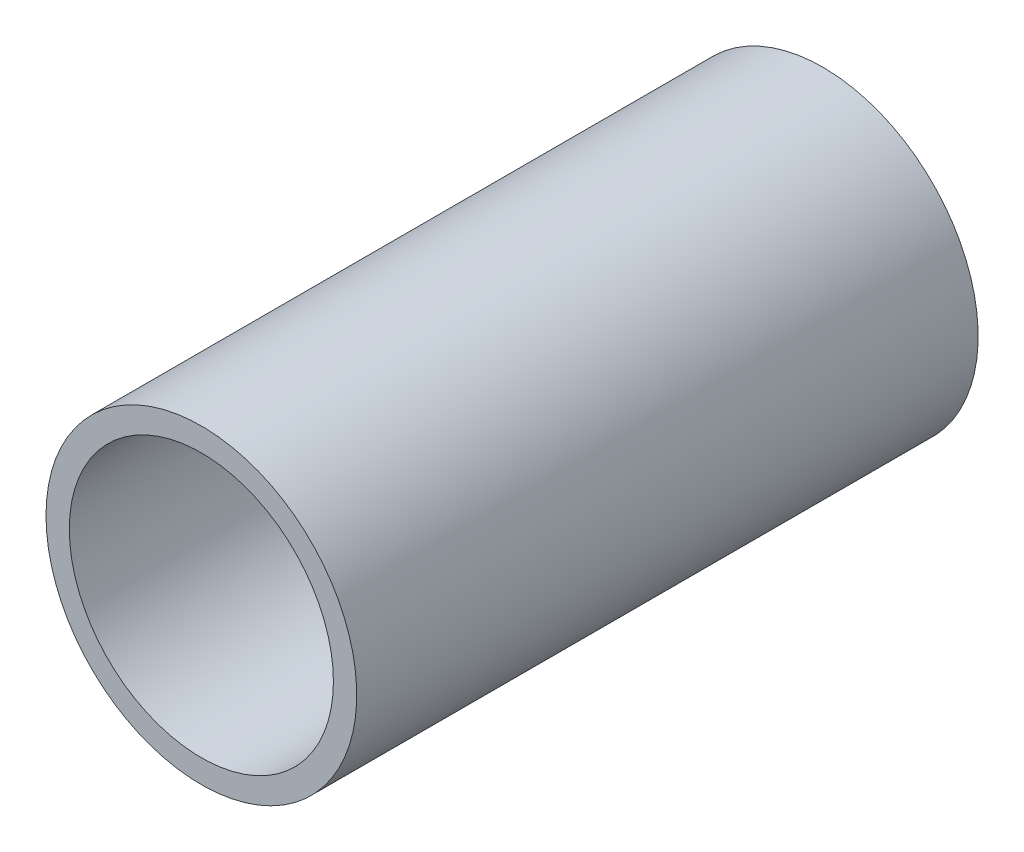
ISO-10303-21;
HEADER;
FILE_DESCRIPTION(('STEP AP214'),'2;1');
FILE_NAME('part.step','',(''),(''),'','','');
FILE_SCHEMA(('AUTOMOTIVE_DESIGN { 1 0 10303 214 1 1 1 1 }'));
ENDSEC;
DATA;
#1=APPLICATION_CONTEXT('core data for automotive mechanical design processes');
#2=APPLICATION_PROTOCOL_DEFINITION('international standard','automotive_design',2000,#1);
#3=PRODUCT_CONTEXT('',#1,'mechanical');
#4=PRODUCT('Part','Part','',(#3));
#5=PRODUCT_RELATED_PRODUCT_CATEGORY('part','',(#4));
#6=PRODUCT_DEFINITION_FORMATION('','',#4);
#7=PRODUCT_DEFINITION_CONTEXT('part definition',#1,'design');
#8=PRODUCT_DEFINITION('design','',#6,#7);
#9=PRODUCT_DEFINITION_SHAPE('','',#8);
#10=(LENGTH_UNIT() NAMED_UNIT(*) SI_UNIT(.MILLI.,.METRE.));
#11=(NAMED_UNIT(*) PLANE_ANGLE_UNIT() SI_UNIT($,.RADIAN.));
#12=(NAMED_UNIT(*) SI_UNIT($,.STERADIAN.) SOLID_ANGLE_UNIT());
#13=UNCERTAINTY_MEASURE_WITH_UNIT(LENGTH_MEASURE(1.E-05),#10,'distance_accuracy_value','');
#14=(GEOMETRIC_REPRESENTATION_CONTEXT(3) GLOBAL_UNCERTAINTY_ASSIGNED_CONTEXT((#13)) GLOBAL_UNIT_ASSIGNED_CONTEXT((#10,
#11,#12)) REPRESENTATION_CONTEXT('',''));
#15=CARTESIAN_POINT('',(0.,0.,0.));
#16=DIRECTION('',(0.,0.,1.));
#17=DIRECTION('',(1.,0.,0.));
#18=AXIS2_PLACEMENT_3D('',#15,#16,#17);
#19=CARTESIAN_POINT('',(-43.5380690102452,71.0530422397824,-44.));
#20=DIRECTION('',(0.,0.,-1.));
#21=DIRECTION('',(-1.,0.,0.));
#22=AXIS2_PLACEMENT_3D('',#19,#20,#21);
#23=PLANE('',#22);
#24=CARTESIAN_POINT('',(-43.5380690102452,71.0530422397824,-44.));
#25=DIRECTION('',(0.,0.,-1.));
#26=DIRECTION('',(-1.,0.,0.));
#27=AXIS2_PLACEMENT_3D('',#24,#25,#26);
#28=CIRCLE('',#27,10.);
#29=CARTESIAN_POINT('',(-53.5380690102452,71.0530422397824,-44.));
#30=VERTEX_POINT('',#29);
#31=EDGE_CURVE('E10',#30,#30,#28,.T.);
#32=ORIENTED_EDGE('',*,*,#31,.T.);
#33=EDGE_LOOP('',(#32));
#34=FACE_BOUND('',#33,.T.);
#35=CARTESIAN_POINT('',(-43.5380690102452,71.0530422397824,-44.));
#36=DIRECTION('',(0.,0.,-1.));
#37=DIRECTION('',(-1.,0.,0.));
#38=AXIS2_PLACEMENT_3D('',#35,#36,#37);
#39=CIRCLE('',#38,8.5);
#40=CARTESIAN_POINT('',(-52.0380690102452,71.0530422397824,-44.));
#41=VERTEX_POINT('',#40);
#42=EDGE_CURVE('E42',#41,#41,#39,.T.);
#43=ORIENTED_EDGE('',*,*,#42,.F.);
#44=EDGE_LOOP('',(#43));
#45=FACE_BOUND('',#44,.T.);
#46=ADVANCED_FACE('F31',(#34,#45),#23,.T.);
#47=CARTESIAN_POINT('',(-43.5380690102452,71.0530422397824,-4.));
#48=DIRECTION('',(0.,0.,-1.));
#49=DIRECTION('',(-1.,0.,0.));
#50=AXIS2_PLACEMENT_3D('',#47,#48,#49);
#51=PLANE('',#50);
#52=CARTESIAN_POINT('',(-43.5380690102452,71.0530422397824,-4.));
#53=DIRECTION('',(0.,0.,-1.));
#54=DIRECTION('',(-1.,0.,0.));
#55=AXIS2_PLACEMENT_3D('',#52,#53,#54);
#56=CIRCLE('',#55,10.);
#57=CARTESIAN_POINT('',(-53.5380690102452,71.0530422397824,-4.));
#58=VERTEX_POINT('',#57);
#59=EDGE_CURVE('E35',#58,#58,#56,.T.);
#60=ORIENTED_EDGE('',*,*,#59,.F.);
#61=EDGE_LOOP('',(#60));
#62=FACE_BOUND('',#61,.T.);
#63=CARTESIAN_POINT('',(-43.5380690102452,71.0530422397824,-4.));
#64=DIRECTION('',(0.,0.,-1.));
#65=DIRECTION('',(-1.,0.,0.));
#66=AXIS2_PLACEMENT_3D('',#63,#64,#65);
#67=CIRCLE('',#66,8.5);
#68=CARTESIAN_POINT('',(-52.0380690102452,71.0530422397824,-4.));
#69=VERTEX_POINT('',#68);
#70=EDGE_CURVE('E44',#69,#69,#67,.T.);
#71=ORIENTED_EDGE('',*,*,#70,.T.);
#72=EDGE_LOOP('',(#71));
#73=FACE_BOUND('',#72,.T.);
#74=ADVANCED_FACE('F54',(#62,#73),#51,.F.);
#75=CARTESIAN_POINT('',(-43.5380690102452,71.0530422397824,-44.));
#76=DIRECTION('',(0.,0.,1.));
#77=DIRECTION('',(1.,0.,0.));
#78=AXIS2_PLACEMENT_3D('',#75,#76,#77);
#79=CYLINDRICAL_SURFACE('',#78,10.);
#80=ORIENTED_EDGE('',*,*,#31,.F.);
#81=EDGE_LOOP('',(#80));
#82=FACE_BOUND('',#81,.T.);
#83=ORIENTED_EDGE('',*,*,#59,.T.);
#84=EDGE_LOOP('',(#83));
#85=FACE_BOUND('',#84,.T.);
#86=ADVANCED_FACE('F33',(#82,#85),#79,.T.);
#87=CARTESIAN_POINT('',(-43.5380690102452,71.0530422397824,-44.));
#88=DIRECTION('',(0.,0.,1.));
#89=DIRECTION('',(1.,0.,0.));
#90=AXIS2_PLACEMENT_3D('',#87,#88,#89);
#91=CYLINDRICAL_SURFACE('',#90,8.5);
#92=ORIENTED_EDGE('',*,*,#42,.T.);
#93=EDGE_LOOP('',(#92));
#94=FACE_BOUND('',#93,.T.);
#95=ORIENTED_EDGE('',*,*,#70,.F.);
#96=EDGE_LOOP('',(#95));
#97=FACE_BOUND('',#96,.T.);
#98=ADVANCED_FACE('F50',(#94,#97),#91,.F.);
#99=CLOSED_SHELL('',(#46,#74,#86,#98));
#100=MANIFOLD_SOLID_BREP('B2',#99);
#101=ADVANCED_BREP_SHAPE_REPRESENTATION('',(#18,#100),#14);
#102=SHAPE_DEFINITION_REPRESENTATION(#9,#101);
ENDSEC;
END-ISO-10303-21;
